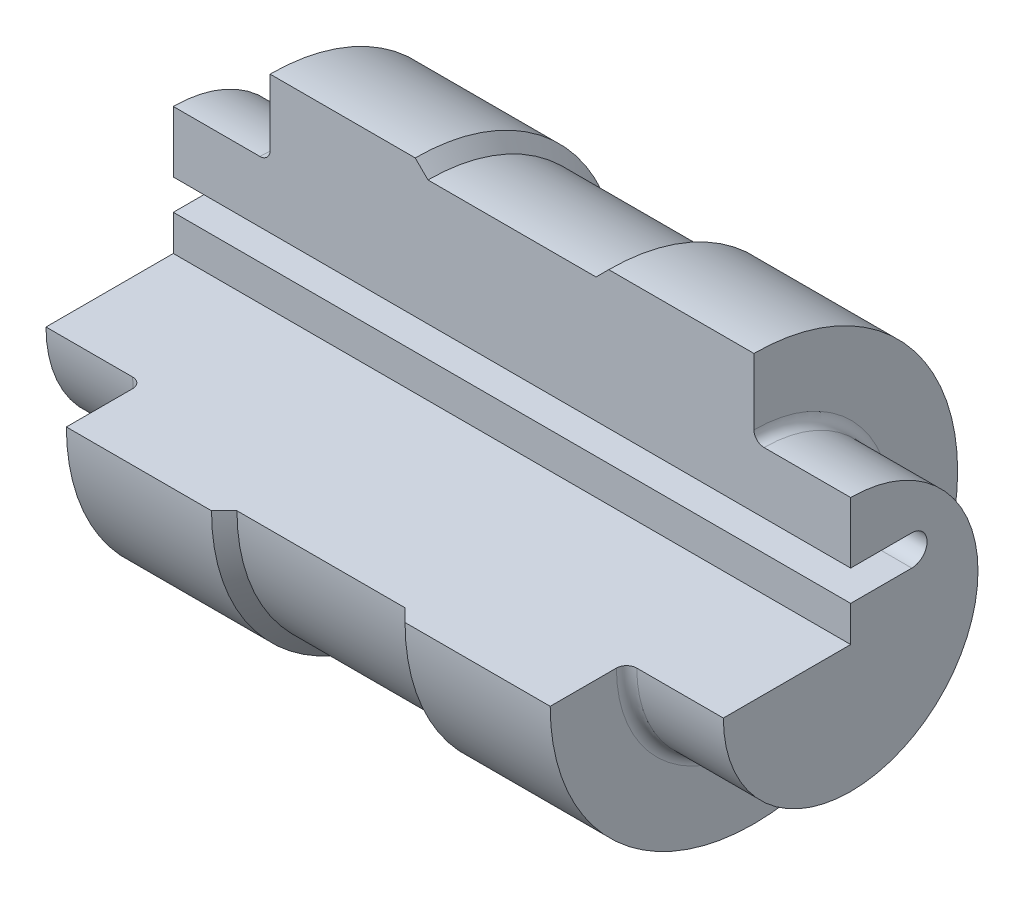
ISO-10303-21;
HEADER;
FILE_DESCRIPTION(('STEP AP214'),'2;1');
FILE_NAME('part.step','',(''),(''),'','','');
FILE_SCHEMA(('AUTOMOTIVE_DESIGN { 1 0 10303 214 1 1 1 1 }'));
ENDSEC;
DATA;
#1=APPLICATION_CONTEXT('core data for automotive mechanical design processes');
#2=APPLICATION_PROTOCOL_DEFINITION('international standard','automotive_design',2000,#1);
#3=PRODUCT_CONTEXT('',#1,'mechanical');
#4=PRODUCT('Part','Part','',(#3));
#5=PRODUCT_RELATED_PRODUCT_CATEGORY('part','',(#4));
#6=PRODUCT_DEFINITION_FORMATION('','',#4);
#7=PRODUCT_DEFINITION_CONTEXT('part definition',#1,'design');
#8=PRODUCT_DEFINITION('design','',#6,#7);
#9=PRODUCT_DEFINITION_SHAPE('','',#8);
#10=(LENGTH_UNIT() NAMED_UNIT(*) SI_UNIT(.MILLI.,.METRE.));
#11=(NAMED_UNIT(*) PLANE_ANGLE_UNIT() SI_UNIT($,.RADIAN.));
#12=(NAMED_UNIT(*) SI_UNIT($,.STERADIAN.) SOLID_ANGLE_UNIT());
#13=UNCERTAINTY_MEASURE_WITH_UNIT(LENGTH_MEASURE(1.E-05),#10,'distance_accuracy_value','');
#14=(GEOMETRIC_REPRESENTATION_CONTEXT(3) GLOBAL_UNCERTAINTY_ASSIGNED_CONTEXT((#13)) GLOBAL_UNIT_ASSIGNED_CONTEXT((#10,
#11,#12)) REPRESENTATION_CONTEXT('',''));
#15=CARTESIAN_POINT('',(0.,0.,0.));
#16=DIRECTION('',(0.,0.,1.));
#17=DIRECTION('',(1.,0.,0.));
#18=AXIS2_PLACEMENT_3D('',#15,#16,#17);
#19=CARTESIAN_POINT('',(0.,0.,0.));
#20=DIRECTION('',(-1.,0.,0.));
#21=DIRECTION('',(0.,-1.,0.));
#22=AXIS2_PLACEMENT_3D('',#19,#20,#21);
#23=PLANE('',#22);
#24=DIRECTION('',(0.,0.,1.));
#25=VECTOR('',#24,1.);
#26=CARTESIAN_POINT('',(0.,0.,40.));
#27=LINE('',#26,#25);
#28=CARTESIAN_POINT('',(0.,0.,0.));
#29=VERTEX_POINT('',#28);
#30=CARTESIAN_POINT('',(0.,0.,25.));
#31=VERTEX_POINT('',#30);
#32=EDGE_CURVE('E203',#29,#31,#27,.T.);
#33=ORIENTED_EDGE('',*,*,#32,.F.);
#34=DIRECTION('',(0.,-1.,0.));
#35=VECTOR('',#34,1.);
#36=CARTESIAN_POINT('',(0.,0.,0.));
#37=LINE('',#36,#35);
#38=CARTESIAN_POINT('',(0.,6.99999999999999,0.));
#39=VERTEX_POINT('',#38);
#40=EDGE_CURVE('E189',#39,#29,#37,.T.);
#41=ORIENTED_EDGE('',*,*,#40,.F.);
#42=DIRECTION('',(0.,0.,1.));
#43=VECTOR('',#42,1.);
#44=CARTESIAN_POINT('',(0.,6.99999999999999,0.));
#45=LINE('',#44,#43);
#46=CARTESIAN_POINT('',(0.,6.99999999999999,-12.));
#47=VERTEX_POINT('',#46);
#48=EDGE_CURVE('E215',#47,#39,#45,.T.);
#49=ORIENTED_EDGE('',*,*,#48,.F.);
#50=CARTESIAN_POINT('',(0.,9.99999999999999,-12.));
#51=DIRECTION('',(-1.,0.,0.));
#52=DIRECTION('',(0.,1.,0.));
#53=AXIS2_PLACEMENT_3D('',#50,#51,#52);
#54=CIRCLE('',#53,3.);
#55=CARTESIAN_POINT('',(0.,13.,-12.));
#56=VERTEX_POINT('',#55);
#57=EDGE_CURVE('E211',#56,#47,#54,.T.);
#58=ORIENTED_EDGE('',*,*,#57,.F.);
#59=DIRECTION('',(0.,0.,-1.));
#60=VECTOR('',#59,1.);
#61=CARTESIAN_POINT('',(0.,13.,-12.));
#62=LINE('',#61,#60);
#63=CARTESIAN_POINT('',(0.,13.,0.));
#64=VERTEX_POINT('',#63);
#65=EDGE_CURVE('E208',#64,#56,#62,.T.);
#66=ORIENTED_EDGE('',*,*,#65,.F.);
#67=DIRECTION('',(0.,-1.,0.));
#68=VECTOR('',#67,1.);
#69=CARTESIAN_POINT('',(0.,13.,0.));
#70=LINE('',#69,#68);
#71=CARTESIAN_POINT('',(0.,25.,0.));
#72=VERTEX_POINT('',#71);
#73=EDGE_CURVE('E163',#72,#64,#70,.T.);
#74=ORIENTED_EDGE('',*,*,#73,.F.);
#75=CARTESIAN_POINT('',(0.,0.,0.));
#76=DIRECTION('',(1.,0.,0.));
#77=DIRECTION('',(0.,1.,0.));
#78=AXIS2_PLACEMENT_3D('',#75,#76,#77);
#79=CIRCLE('',#78,25.);
#80=EDGE_CURVE('E314',#31,#72,#79,.T.);
#81=ORIENTED_EDGE('',*,*,#80,.F.);
#82=EDGE_LOOP('',(#33,#41,#49,#58,#66,#74,#81));
#83=FACE_BOUND('',#82,.T.);
#84=ADVANCED_FACE('F39',(#83),#23,.T.);
#85=CARTESIAN_POINT('',(133.,0.,0.));
#86=DIRECTION('',(1.,0.,0.));
#87=DIRECTION('',(0.,1.,0.));
#88=AXIS2_PLACEMENT_3D('',#85,#86,#87);
#89=CYLINDRICAL_SURFACE('',#88,25.);
#90=DIRECTION('',(1.,0.,0.));
#91=VECTOR('',#90,1.);
#92=CARTESIAN_POINT('',(133.,0.,25.));
#93=LINE('',#92,#91);
#94=CARTESIAN_POINT('',(17.,0.,25.));
#95=VERTEX_POINT('',#94);
#96=EDGE_CURVE('E277',#31,#95,#93,.T.);
#97=ORIENTED_EDGE('',*,*,#96,.F.);
#98=ORIENTED_EDGE('',*,*,#80,.T.);
#99=DIRECTION('',(1.,0.,0.));
#100=VECTOR('',#99,1.);
#101=CARTESIAN_POINT('',(133.,25.,0.));
#102=LINE('',#101,#100);
#103=CARTESIAN_POINT('',(17.,25.,0.));
#104=VERTEX_POINT('',#103);
#105=EDGE_CURVE('E252',#104,#72,#102,.F.);
#106=ORIENTED_EDGE('',*,*,#105,.F.);
#107=CARTESIAN_POINT('',(17.,0.,0.));
#108=DIRECTION('',(-1.,0.,0.));
#109=DIRECTION('',(0.,-1.,0.));
#110=AXIS2_PLACEMENT_3D('',#107,#108,#109);
#111=CIRCLE('',#110,25.);
#112=EDGE_CURVE('E322',#104,#95,#111,.T.);
#113=ORIENTED_EDGE('',*,*,#112,.T.);
#114=EDGE_LOOP('',(#97,#98,#106,#113));
#115=FACE_BOUND('',#114,.T.);
#116=ADVANCED_FACE('F353',(#115),#89,.T.);
#117=CARTESIAN_POINT('',(19.,25.,0.));
#118=DIRECTION('',(-1.,0.,0.));
#119=DIRECTION('',(0.,-1.,0.));
#120=AXIS2_PLACEMENT_3D('',#117,#118,#119);
#121=PLANE('',#120);
#122=DIRECTION('',(0.,0.,1.));
#123=VECTOR('',#122,1.);
#124=CARTESIAN_POINT('',(19.,0.,0.));
#125=LINE('',#124,#123);
#126=CARTESIAN_POINT('',(19.,0.,27.));
#127=VERTEX_POINT('',#126);
#128=CARTESIAN_POINT('',(19.,0.,40.));
#129=VERTEX_POINT('',#128);
#130=EDGE_CURVE('E274',#127,#129,#125,.T.);
#131=ORIENTED_EDGE('',*,*,#130,.F.);
#132=CARTESIAN_POINT('',(19.,0.,0.));
#133=DIRECTION('',(-1.,0.,0.));
#134=DIRECTION('',(0.,-1.,0.));
#135=AXIS2_PLACEMENT_3D('',#132,#133,#134);
#136=CIRCLE('',#135,27.);
#137=CARTESIAN_POINT('',(19.,27.,0.));
#138=VERTEX_POINT('',#137);
#139=EDGE_CURVE('E318',#127,#138,#136,.F.);
#140=ORIENTED_EDGE('',*,*,#139,.T.);
#141=DIRECTION('',(0.,-1.,0.));
#142=VECTOR('',#141,1.);
#143=CARTESIAN_POINT('',(19.,25.,0.));
#144=LINE('',#143,#142);
#145=CARTESIAN_POINT('',(19.,40.,0.));
#146=VERTEX_POINT('',#145);
#147=EDGE_CURVE('E249',#146,#138,#144,.T.);
#148=ORIENTED_EDGE('',*,*,#147,.F.);
#149=CARTESIAN_POINT('',(19.,0.,0.));
#150=DIRECTION('',(1.,0.,0.));
#151=DIRECTION('',(0.,1.,0.));
#152=AXIS2_PLACEMENT_3D('',#149,#150,#151);
#153=CIRCLE('',#152,40.);
#154=EDGE_CURVE('E310',#129,#146,#153,.T.);
#155=ORIENTED_EDGE('',*,*,#154,.F.);
#156=EDGE_LOOP('',(#131,#140,#148,#155));
#157=FACE_BOUND('',#156,.T.);
#158=ADVANCED_FACE('F375',(#157),#121,.T.);
#159=CARTESIAN_POINT('',(133.,0.,0.));
#160=DIRECTION('',(1.,0.,0.));
#161=DIRECTION('',(0.,1.,0.));
#162=AXIS2_PLACEMENT_3D('',#159,#160,#161);
#163=CYLINDRICAL_SURFACE('',#162,40.);
#164=DIRECTION('',(-1.,0.,0.));
#165=VECTOR('',#164,1.);
#166=CARTESIAN_POINT('',(133.,0.,40.));
#167=LINE('',#166,#165);
#168=CARTESIAN_POINT('',(47.5,0.,40.));
#169=VERTEX_POINT('',#168);
#170=EDGE_CURVE('E202',#169,#129,#167,.T.);
#171=ORIENTED_EDGE('',*,*,#170,.T.);
#172=ORIENTED_EDGE('',*,*,#154,.T.);
#173=DIRECTION('',(-1.,0.,0.));
#174=VECTOR('',#173,1.);
#175=CARTESIAN_POINT('',(133.,40.,0.));
#176=LINE('',#175,#174);
#177=CARTESIAN_POINT('',(47.5,40.,0.));
#178=VERTEX_POINT('',#177);
#179=EDGE_CURVE('E233',#178,#146,#176,.T.);
#180=ORIENTED_EDGE('',*,*,#179,.F.);
#181=CARTESIAN_POINT('',(47.5,0.,0.));
#182=DIRECTION('',(1.,0.,0.));
#183=DIRECTION('',(0.,1.,0.));
#184=AXIS2_PLACEMENT_3D('',#181,#182,#183);
#185=CIRCLE('',#184,40.);
#186=EDGE_CURVE('E306',#169,#178,#185,.T.);
#187=ORIENTED_EDGE('',*,*,#186,.F.);
#188=EDGE_LOOP('',(#171,#172,#180,#187));
#189=FACE_BOUND('',#188,.T.);
#190=ADVANCED_FACE('F393',(#189),#163,.T.);
#191=CARTESIAN_POINT('',(50.,0.,0.));
#192=DIRECTION('',(-1.,0.,0.));
#193=DIRECTION('',(0.,-1.,0.));
#194=AXIS2_PLACEMENT_3D('',#191,#192,#193);
#195=CONICAL_SURFACE('',#194,37.5,0.785398163397448);
#196=DIRECTION('',(-0.707106781186548,0.,0.707106781186547));
#197=VECTOR('',#196,1.);
#198=CARTESIAN_POINT('',(87.5,0.,0.));
#199=LINE('',#198,#197);
#200=CARTESIAN_POINT('',(50.,0.,37.5));
#201=VERTEX_POINT('',#200);
#202=EDGE_CURVE('E63',#169,#201,#199,.F.);
#203=ORIENTED_EDGE('',*,*,#202,.F.);
#204=ORIENTED_EDGE('',*,*,#186,.T.);
#205=DIRECTION('',(0.707106781186548,-0.707106781186547,0.));
#206=VECTOR('',#205,1.);
#207=CARTESIAN_POINT('',(87.5,0.,0.));
#208=LINE('',#207,#206);
#209=CARTESIAN_POINT('',(50.,37.5,0.));
#210=VERTEX_POINT('',#209);
#211=EDGE_CURVE('E261',#210,#178,#208,.F.);
#212=ORIENTED_EDGE('',*,*,#211,.F.);
#213=CARTESIAN_POINT('',(50.,0.,0.));
#214=DIRECTION('',(1.,0.,0.));
#215=DIRECTION('',(0.,1.,0.));
#216=AXIS2_PLACEMENT_3D('',#213,#214,#215);
#217=CIRCLE('',#216,37.5);
#218=EDGE_CURVE('E302',#201,#210,#217,.T.);
#219=ORIENTED_EDGE('',*,*,#218,.F.);
#220=EDGE_LOOP('',(#203,#204,#212,#219));
#221=FACE_BOUND('',#220,.T.);
#222=ADVANCED_FACE('F397',(#221),#195,.T.);
#223=CARTESIAN_POINT('',(133.,0.,0.));
#224=DIRECTION('',(1.,0.,0.));
#225=DIRECTION('',(0.,1.,0.));
#226=AXIS2_PLACEMENT_3D('',#223,#224,#225);
#227=CYLINDRICAL_SURFACE('',#226,37.5);
#228=DIRECTION('',(1.,0.,0.));
#229=VECTOR('',#228,1.);
#230=CARTESIAN_POINT('',(133.,0.,37.5));
#231=LINE('',#230,#229);
#232=CARTESIAN_POINT('',(83.,0.,37.5));
#233=VERTEX_POINT('',#232);
#234=EDGE_CURVE('E283',#201,#233,#231,.T.);
#235=ORIENTED_EDGE('',*,*,#234,.F.);
#236=ORIENTED_EDGE('',*,*,#218,.T.);
#237=DIRECTION('',(1.,0.,0.));
#238=VECTOR('',#237,1.);
#239=CARTESIAN_POINT('',(133.,37.5,0.));
#240=LINE('',#239,#238);
#241=CARTESIAN_POINT('',(83.,37.5,0.));
#242=VERTEX_POINT('',#241);
#243=EDGE_CURVE('E258',#242,#210,#240,.F.);
#244=ORIENTED_EDGE('',*,*,#243,.F.);
#245=CARTESIAN_POINT('',(83.,0.,0.));
#246=DIRECTION('',(1.,0.,0.));
#247=DIRECTION('',(0.,1.,0.));
#248=AXIS2_PLACEMENT_3D('',#245,#246,#247);
#249=CIRCLE('',#248,37.5);
#250=EDGE_CURVE('E298',#233,#242,#249,.T.);
#251=ORIENTED_EDGE('',*,*,#250,.F.);
#252=EDGE_LOOP('',(#235,#236,#244,#251));
#253=FACE_BOUND('',#252,.T.);
#254=ADVANCED_FACE('F401',(#253),#227,.T.);
#255=CARTESIAN_POINT('',(85.5,0.,0.));
#256=DIRECTION('',(1.,0.,0.));
#257=DIRECTION('',(0.,1.,0.));
#258=AXIS2_PLACEMENT_3D('',#255,#256,#257);
#259=CONICAL_SURFACE('',#258,40.,0.785398163397447);
#260=DIRECTION('',(-0.707106781186548,0.,-0.707106781186547));
#261=VECTOR('',#260,1.);
#262=CARTESIAN_POINT('',(45.4999999999999,0.,0.));
#263=LINE('',#262,#261);
#264=CARTESIAN_POINT('',(85.5,0.,40.));
#265=VERTEX_POINT('',#264);
#266=EDGE_CURVE('E280',#233,#265,#263,.F.);
#267=ORIENTED_EDGE('',*,*,#266,.F.);
#268=ORIENTED_EDGE('',*,*,#250,.T.);
#269=DIRECTION('',(0.707106781186548,0.707106781186547,0.));
#270=VECTOR('',#269,1.);
#271=CARTESIAN_POINT('',(45.4999999999999,0.,0.));
#272=LINE('',#271,#270);
#273=CARTESIAN_POINT('',(85.5,40.,0.));
#274=VERTEX_POINT('',#273);
#275=EDGE_CURVE('E255',#274,#242,#272,.F.);
#276=ORIENTED_EDGE('',*,*,#275,.F.);
#277=CARTESIAN_POINT('',(85.5,0.,0.));
#278=DIRECTION('',(1.,0.,0.));
#279=DIRECTION('',(0.,1.,0.));
#280=AXIS2_PLACEMENT_3D('',#277,#278,#279);
#281=CIRCLE('',#280,40.);
#282=EDGE_CURVE('E294',#265,#274,#281,.T.);
#283=ORIENTED_EDGE('',*,*,#282,.F.);
#284=EDGE_LOOP('',(#267,#268,#276,#283));
#285=FACE_BOUND('',#284,.T.);
#286=ADVANCED_FACE('F407',(#285),#259,.T.);
#287=CARTESIAN_POINT('',(133.,0.,0.));
#288=DIRECTION('',(1.,0.,0.));
#289=DIRECTION('',(0.,1.,0.));
#290=AXIS2_PLACEMENT_3D('',#287,#288,#289);
#291=CYLINDRICAL_SURFACE('',#290,40.);
#292=CARTESIAN_POINT('',(114.,0.,40.));
#293=VERTEX_POINT('',#292);
#294=EDGE_CURVE('E236',#293,#265,#167,.T.);
#295=ORIENTED_EDGE('',*,*,#294,.T.);
#296=ORIENTED_EDGE('',*,*,#282,.T.);
#297=CARTESIAN_POINT('',(114.,40.,0.));
#298=VERTEX_POINT('',#297);
#299=EDGE_CURVE('E169',#298,#274,#176,.T.);
#300=ORIENTED_EDGE('',*,*,#299,.F.);
#301=CARTESIAN_POINT('',(114.,0.,0.));
#302=DIRECTION('',(1.,0.,0.));
#303=DIRECTION('',(0.,1.,0.));
#304=AXIS2_PLACEMENT_3D('',#301,#302,#303);
#305=CIRCLE('',#304,40.);
#306=EDGE_CURVE('E290',#293,#298,#305,.T.);
#307=ORIENTED_EDGE('',*,*,#306,.F.);
#308=EDGE_LOOP('',(#295,#296,#300,#307));
#309=FACE_BOUND('',#308,.T.);
#310=ADVANCED_FACE('F411',(#309),#291,.T.);
#311=CARTESIAN_POINT('',(114.,40.,0.));
#312=DIRECTION('',(1.,0.,0.));
#313=DIRECTION('',(0.,1.,0.));
#314=AXIS2_PLACEMENT_3D('',#311,#312,#313);
#315=PLANE('',#314);
#316=DIRECTION('',(0.,0.,-1.));
#317=VECTOR('',#316,1.);
#318=CARTESIAN_POINT('',(114.,0.,0.));
#319=LINE('',#318,#317);
#320=CARTESIAN_POINT('',(114.,0.,27.));
#321=VERTEX_POINT('',#320);
#322=EDGE_CURVE('E267',#293,#321,#319,.T.);
#323=ORIENTED_EDGE('',*,*,#322,.F.);
#324=ORIENTED_EDGE('',*,*,#306,.T.);
#325=DIRECTION('',(0.,1.,0.));
#326=VECTOR('',#325,1.);
#327=CARTESIAN_POINT('',(114.,40.,0.));
#328=LINE('',#327,#326);
#329=CARTESIAN_POINT('',(114.,27.,0.));
#330=VERTEX_POINT('',#329);
#331=EDGE_CURVE('E242',#330,#298,#328,.T.);
#332=ORIENTED_EDGE('',*,*,#331,.F.);
#333=CARTESIAN_POINT('',(114.,0.,0.));
#334=DIRECTION('',(1.,0.,0.));
#335=DIRECTION('',(0.,1.,0.));
#336=AXIS2_PLACEMENT_3D('',#333,#334,#335);
#337=CIRCLE('',#336,27.);
#338=EDGE_CURVE('E330',#330,#321,#337,.F.);
#339=ORIENTED_EDGE('',*,*,#338,.T.);
#340=EDGE_LOOP('',(#323,#324,#332,#339));
#341=FACE_BOUND('',#340,.T.);
#342=ADVANCED_FACE('F417',(#341),#315,.T.);
#343=CARTESIAN_POINT('',(133.,0.,0.));
#344=DIRECTION('',(1.,0.,0.));
#345=DIRECTION('',(0.,1.,0.));
#346=AXIS2_PLACEMENT_3D('',#343,#344,#345);
#347=CYLINDRICAL_SURFACE('',#346,25.);
#348=DIRECTION('',(1.,0.,0.));
#349=VECTOR('',#348,1.);
#350=CARTESIAN_POINT('',(133.,0.,25.));
#351=LINE('',#350,#349);
#352=CARTESIAN_POINT('',(116.,0.,25.));
#353=VERTEX_POINT('',#352);
#354=CARTESIAN_POINT('',(133.,0.,25.));
#355=VERTEX_POINT('',#354);
#356=EDGE_CURVE('E264',#353,#355,#351,.T.);
#357=ORIENTED_EDGE('',*,*,#356,.F.);
#358=CARTESIAN_POINT('',(116.,0.,0.));
#359=DIRECTION('',(1.,0.,0.));
#360=DIRECTION('',(0.,1.,0.));
#361=AXIS2_PLACEMENT_3D('',#358,#359,#360);
#362=CIRCLE('',#361,25.);
#363=CARTESIAN_POINT('',(116.,25.,0.));
#364=VERTEX_POINT('',#363);
#365=EDGE_CURVE('E326',#353,#364,#362,.T.);
#366=ORIENTED_EDGE('',*,*,#365,.T.);
#367=DIRECTION('',(1.,0.,0.));
#368=VECTOR('',#367,1.);
#369=CARTESIAN_POINT('',(133.,25.,0.));
#370=LINE('',#369,#368);
#371=CARTESIAN_POINT('',(133.,25.,0.));
#372=VERTEX_POINT('',#371);
#373=EDGE_CURVE('E55',#372,#364,#370,.F.);
#374=ORIENTED_EDGE('',*,*,#373,.F.);
#375=CARTESIAN_POINT('',(133.,0.,0.));
#376=DIRECTION('',(1.,0.,0.));
#377=DIRECTION('',(0.,1.,0.));
#378=AXIS2_PLACEMENT_3D('',#375,#376,#377);
#379=CIRCLE('',#378,25.);
#380=EDGE_CURVE('E184',#355,#372,#379,.T.);
#381=ORIENTED_EDGE('',*,*,#380,.F.);
#382=EDGE_LOOP('',(#357,#366,#374,#381));
#383=FACE_BOUND('',#382,.T.);
#384=ADVANCED_FACE('F340',(#383),#347,.T.);
#385=CARTESIAN_POINT('',(133.,25.,0.));
#386=DIRECTION('',(1.,0.,0.));
#387=DIRECTION('',(0.,1.,0.));
#388=AXIS2_PLACEMENT_3D('',#385,#386,#387);
#389=PLANE('',#388);
#390=DIRECTION('',(0.,0.,1.));
#391=VECTOR('',#390,1.);
#392=CARTESIAN_POINT('',(133.,0.,40.));
#393=LINE('',#392,#391);
#394=CARTESIAN_POINT('',(133.,0.,0.));
#395=VERTEX_POINT('',#394);
#396=EDGE_CURVE('E186',#395,#355,#393,.T.);
#397=ORIENTED_EDGE('',*,*,#396,.T.);
#398=ORIENTED_EDGE('',*,*,#380,.T.);
#399=DIRECTION('',(0.,-1.,0.));
#400=VECTOR('',#399,1.);
#401=CARTESIAN_POINT('',(133.,13.,0.));
#402=LINE('',#401,#400);
#403=CARTESIAN_POINT('',(133.,13.,0.));
#404=VERTEX_POINT('',#403);
#405=EDGE_CURVE('E161',#372,#404,#402,.T.);
#406=ORIENTED_EDGE('',*,*,#405,.T.);
#407=DIRECTION('',(0.,0.,-1.));
#408=VECTOR('',#407,1.);
#409=CARTESIAN_POINT('',(133.,13.,-12.));
#410=LINE('',#409,#408);
#411=CARTESIAN_POINT('',(133.,13.,-12.));
#412=VERTEX_POINT('',#411);
#413=EDGE_CURVE('E172',#404,#412,#410,.T.);
#414=ORIENTED_EDGE('',*,*,#413,.T.);
#415=CARTESIAN_POINT('',(133.,9.99999999999999,-12.));
#416=DIRECTION('',(-1.,0.,0.));
#417=DIRECTION('',(0.,1.,0.));
#418=AXIS2_PLACEMENT_3D('',#415,#416,#417);
#419=CIRCLE('',#418,3.);
#420=CARTESIAN_POINT('',(133.,6.99999999999999,-12.));
#421=VERTEX_POINT('',#420);
#422=EDGE_CURVE('E178',#412,#421,#419,.T.);
#423=ORIENTED_EDGE('',*,*,#422,.T.);
#424=DIRECTION('',(0.,0.,1.));
#425=VECTOR('',#424,1.);
#426=CARTESIAN_POINT('',(133.,6.99999999999999,0.));
#427=LINE('',#426,#425);
#428=CARTESIAN_POINT('',(133.,6.99999999999999,0.));
#429=VERTEX_POINT('',#428);
#430=EDGE_CURVE('E194',#421,#429,#427,.T.);
#431=ORIENTED_EDGE('',*,*,#430,.T.);
#432=DIRECTION('',(0.,-1.,0.));
#433=VECTOR('',#432,1.);
#434=CARTESIAN_POINT('',(133.,0.,0.));
#435=LINE('',#434,#433);
#436=EDGE_CURVE('E198',#429,#395,#435,.T.);
#437=ORIENTED_EDGE('',*,*,#436,.T.);
#438=EDGE_LOOP('',(#397,#398,#406,#414,#423,#431,#437));
#439=FACE_BOUND('',#438,.T.);
#440=ADVANCED_FACE('F182',(#439),#389,.T.);
#441=CARTESIAN_POINT('',(17.,0.,0.));
#442=DIRECTION('',(-1.,0.,0.));
#443=DIRECTION('',(0.,-1.,0.));
#444=AXIS2_PLACEMENT_3D('',#441,#442,#443);
#445=TOROIDAL_SURFACE('',#444,27.,2.);
#446=ORIENTED_EDGE('',*,*,#139,.F.);
#447=CARTESIAN_POINT('',(17.,0.,27.));
#448=DIRECTION('',(0.,-1.,0.));
#449=DIRECTION('',(1.,0.,0.));
#450=AXIS2_PLACEMENT_3D('',#447,#448,#449);
#451=CIRCLE('',#450,2.);
#452=EDGE_CURVE('E270',#127,#95,#451,.F.);
#453=ORIENTED_EDGE('',*,*,#452,.T.);
#454=ORIENTED_EDGE('',*,*,#112,.F.);
#455=CARTESIAN_POINT('',(17.,27.,0.));
#456=DIRECTION('',(0.,0.,-1.));
#457=DIRECTION('',(-1.,0.,0.));
#458=AXIS2_PLACEMENT_3D('',#455,#456,#457);
#459=CIRCLE('',#458,2.);
#460=EDGE_CURVE('E245',#104,#138,#459,.F.);
#461=ORIENTED_EDGE('',*,*,#460,.T.);
#462=EDGE_LOOP('',(#446,#453,#454,#461));
#463=FACE_BOUND('',#462,.T.);
#464=ADVANCED_FACE('F378',(#463),#445,.F.);
#465=CARTESIAN_POINT('',(116.,0.,0.));
#466=DIRECTION('',(1.,0.,0.));
#467=DIRECTION('',(0.,1.,0.));
#468=AXIS2_PLACEMENT_3D('',#465,#466,#467);
#469=TOROIDAL_SURFACE('',#468,27.,2.);
#470=ORIENTED_EDGE('',*,*,#365,.F.);
#471=CARTESIAN_POINT('',(116.,0.,27.));
#472=DIRECTION('',(0.,-1.,0.));
#473=DIRECTION('',(1.,0.,0.));
#474=AXIS2_PLACEMENT_3D('',#471,#472,#473);
#475=CIRCLE('',#474,2.);
#476=EDGE_CURVE('E11',#353,#321,#475,.F.);
#477=ORIENTED_EDGE('',*,*,#476,.T.);
#478=ORIENTED_EDGE('',*,*,#338,.F.);
#479=CARTESIAN_POINT('',(116.,27.,0.));
#480=DIRECTION('',(0.,0.,-1.));
#481=DIRECTION('',(-1.,0.,0.));
#482=AXIS2_PLACEMENT_3D('',#479,#480,#481);
#483=CIRCLE('',#482,2.);
#484=EDGE_CURVE('E48',#330,#364,#483,.F.);
#485=ORIENTED_EDGE('',*,*,#484,.T.);
#486=EDGE_LOOP('',(#470,#477,#478,#485));
#487=FACE_BOUND('',#486,.T.);
#488=ADVANCED_FACE('F41',(#487),#469,.F.);
#489=CARTESIAN_POINT('',(133.,0.,40.));
#490=DIRECTION('',(0.,-1.,0.));
#491=DIRECTION('',(1.,0.,0.));
#492=AXIS2_PLACEMENT_3D('',#489,#490,#491);
#493=PLANE('',#492);
#494=ORIENTED_EDGE('',*,*,#202,.T.);
#495=ORIENTED_EDGE('',*,*,#234,.T.);
#496=ORIENTED_EDGE('',*,*,#266,.T.);
#497=ORIENTED_EDGE('',*,*,#294,.F.);
#498=ORIENTED_EDGE('',*,*,#322,.T.);
#499=ORIENTED_EDGE('',*,*,#476,.F.);
#500=ORIENTED_EDGE('',*,*,#356,.T.);
#501=ORIENTED_EDGE('',*,*,#396,.F.);
#502=DIRECTION('',(-1.,0.,0.));
#503=VECTOR('',#502,1.);
#504=CARTESIAN_POINT('',(133.,0.,0.));
#505=LINE('',#504,#503);
#506=EDGE_CURVE('E222',#395,#29,#505,.T.);
#507=ORIENTED_EDGE('',*,*,#506,.T.);
#508=ORIENTED_EDGE('',*,*,#32,.T.);
#509=ORIENTED_EDGE('',*,*,#96,.T.);
#510=ORIENTED_EDGE('',*,*,#452,.F.);
#511=ORIENTED_EDGE('',*,*,#130,.T.);
#512=ORIENTED_EDGE('',*,*,#170,.F.);
#513=EDGE_LOOP('',(#494,#495,#496,#497,#498,#499,#500,#501,#507,#508,#509,#510,#511,#512));
#514=FACE_BOUND('',#513,.T.);
#515=ADVANCED_FACE('F342',(#514),#493,.F.);
#516=CARTESIAN_POINT('',(133.,0.,0.));
#517=DIRECTION('',(0.,0.,-1.));
#518=DIRECTION('',(-1.,0.,0.));
#519=AXIS2_PLACEMENT_3D('',#516,#517,#518);
#520=PLANE('',#519);
#521=ORIENTED_EDGE('',*,*,#40,.T.);
#522=ORIENTED_EDGE('',*,*,#506,.F.);
#523=ORIENTED_EDGE('',*,*,#436,.F.);
#524=DIRECTION('',(-1.,0.,0.));
#525=VECTOR('',#524,1.);
#526=CARTESIAN_POINT('',(133.,6.99999999999999,0.));
#527=LINE('',#526,#525);
#528=EDGE_CURVE('E225',#429,#39,#527,.T.);
#529=ORIENTED_EDGE('',*,*,#528,.T.);
#530=EDGE_LOOP('',(#521,#522,#523,#529));
#531=FACE_BOUND('',#530,.T.);
#532=ADVANCED_FACE('F346',(#531),#520,.F.);
#533=CARTESIAN_POINT('',(133.,6.99999999999999,0.));
#534=DIRECTION('',(0.,-1.,0.));
#535=DIRECTION('',(0.,0.,-1.));
#536=AXIS2_PLACEMENT_3D('',#533,#534,#535);
#537=PLANE('',#536);
#538=ORIENTED_EDGE('',*,*,#48,.T.);
#539=ORIENTED_EDGE('',*,*,#528,.F.);
#540=ORIENTED_EDGE('',*,*,#430,.F.);
#541=DIRECTION('',(-1.,0.,0.));
#542=VECTOR('',#541,1.);
#543=CARTESIAN_POINT('',(133.,6.99999999999999,-12.));
#544=LINE('',#543,#542);
#545=EDGE_CURVE('E228',#421,#47,#544,.T.);
#546=ORIENTED_EDGE('',*,*,#545,.T.);
#547=EDGE_LOOP('',(#538,#539,#540,#546));
#548=FACE_BOUND('',#547,.T.);
#549=ADVANCED_FACE('F361',(#548),#537,.F.);
#550=CARTESIAN_POINT('',(133.,9.99999999999999,-12.));
#551=DIRECTION('',(-1.,0.,0.));
#552=DIRECTION('',(0.,-1.,0.));
#553=AXIS2_PLACEMENT_3D('',#550,#551,#552);
#554=CYLINDRICAL_SURFACE('',#553,3.);
#555=ORIENTED_EDGE('',*,*,#57,.T.);
#556=ORIENTED_EDGE('',*,*,#545,.F.);
#557=ORIENTED_EDGE('',*,*,#422,.F.);
#558=DIRECTION('',(-1.,0.,0.));
#559=VECTOR('',#558,1.);
#560=CARTESIAN_POINT('',(133.,13.,-12.));
#561=LINE('',#560,#559);
#562=EDGE_CURVE('E168',#412,#56,#561,.T.);
#563=ORIENTED_EDGE('',*,*,#562,.T.);
#564=EDGE_LOOP('',(#555,#556,#557,#563));
#565=FACE_BOUND('',#564,.T.);
#566=ADVANCED_FACE('F359',(#565),#554,.F.);
#567=CARTESIAN_POINT('',(133.,13.,-12.));
#568=DIRECTION('',(0.,1.,0.));
#569=DIRECTION('',(0.,0.,1.));
#570=AXIS2_PLACEMENT_3D('',#567,#568,#569);
#571=PLANE('',#570);
#572=ORIENTED_EDGE('',*,*,#65,.T.);
#573=ORIENTED_EDGE('',*,*,#562,.F.);
#574=ORIENTED_EDGE('',*,*,#413,.F.);
#575=DIRECTION('',(-1.,0.,0.));
#576=VECTOR('',#575,1.);
#577=CARTESIAN_POINT('',(133.,13.,0.));
#578=LINE('',#577,#576);
#579=EDGE_CURVE('E157',#404,#64,#578,.T.);
#580=ORIENTED_EDGE('',*,*,#579,.T.);
#581=EDGE_LOOP('',(#572,#573,#574,#580));
#582=FACE_BOUND('',#581,.T.);
#583=ADVANCED_FACE('F173',(#582),#571,.F.);
#584=CARTESIAN_POINT('',(133.,13.,0.));
#585=DIRECTION('',(0.,0.,-1.));
#586=DIRECTION('',(-1.,0.,0.));
#587=AXIS2_PLACEMENT_3D('',#584,#585,#586);
#588=PLANE('',#587);
#589=ORIENTED_EDGE('',*,*,#211,.T.);
#590=ORIENTED_EDGE('',*,*,#179,.T.);
#591=ORIENTED_EDGE('',*,*,#147,.T.);
#592=ORIENTED_EDGE('',*,*,#460,.F.);
#593=ORIENTED_EDGE('',*,*,#105,.T.);
#594=ORIENTED_EDGE('',*,*,#73,.T.);
#595=ORIENTED_EDGE('',*,*,#579,.F.);
#596=ORIENTED_EDGE('',*,*,#405,.F.);
#597=ORIENTED_EDGE('',*,*,#373,.T.);
#598=ORIENTED_EDGE('',*,*,#484,.F.);
#599=ORIENTED_EDGE('',*,*,#331,.T.);
#600=ORIENTED_EDGE('',*,*,#299,.T.);
#601=ORIENTED_EDGE('',*,*,#275,.T.);
#602=ORIENTED_EDGE('',*,*,#243,.T.);
#603=EDGE_LOOP('',(#589,#590,#591,#592,#593,#594,#595,#596,#597,#598,#599,#600,#601,#602));
#604=FACE_BOUND('',#603,.T.);
#605=ADVANCED_FACE('F159',(#604),#588,.F.);
#606=CLOSED_SHELL('',(#84,#116,#158,#190,#222,#254,#286,#310,#342,#384,#440,#464,#488,#515,#532,
#549,#566,#583,#605));
#607=MANIFOLD_SOLID_BREP('B2',#606);
#608=ADVANCED_BREP_SHAPE_REPRESENTATION('',(#18,#607),#14);
#609=SHAPE_DEFINITION_REPRESENTATION(#9,#608);
ENDSEC;
END-ISO-10303-21;
